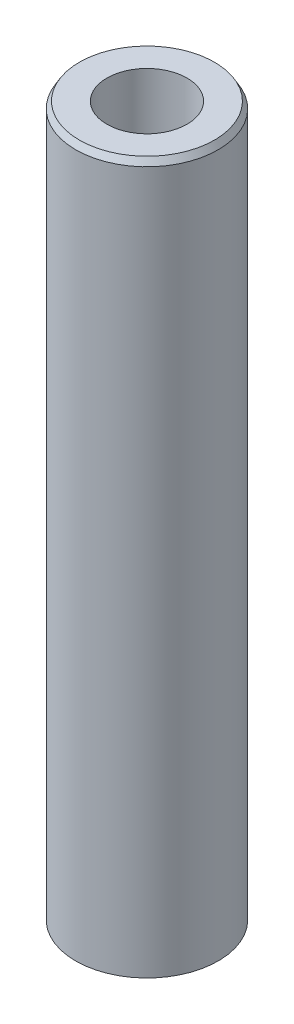
ISO-10303-21;
HEADER;
FILE_DESCRIPTION(('STEP AP214'),'2;1');
FILE_NAME('part.step','',(''),(''),'','','');
FILE_SCHEMA(('AUTOMOTIVE_DESIGN { 1 0 10303 214 1 1 1 1 }'));
ENDSEC;
DATA;
#1=APPLICATION_CONTEXT('core data for automotive mechanical design processes');
#2=APPLICATION_PROTOCOL_DEFINITION('international standard','automotive_design',2000,#1);
#3=PRODUCT_CONTEXT('',#1,'mechanical');
#4=PRODUCT('Part','Part','',(#3));
#5=PRODUCT_RELATED_PRODUCT_CATEGORY('part','',(#4));
#6=PRODUCT_DEFINITION_FORMATION('','',#4);
#7=PRODUCT_DEFINITION_CONTEXT('part definition',#1,'design');
#8=PRODUCT_DEFINITION('design','',#6,#7);
#9=PRODUCT_DEFINITION_SHAPE('','',#8);
#10=(LENGTH_UNIT() NAMED_UNIT(*) SI_UNIT(.MILLI.,.METRE.));
#11=(NAMED_UNIT(*) PLANE_ANGLE_UNIT() SI_UNIT($,.RADIAN.));
#12=(NAMED_UNIT(*) SI_UNIT($,.STERADIAN.) SOLID_ANGLE_UNIT());
#13=UNCERTAINTY_MEASURE_WITH_UNIT(LENGTH_MEASURE(1.E-05),#10,'distance_accuracy_value','');
#14=(GEOMETRIC_REPRESENTATION_CONTEXT(3) GLOBAL_UNCERTAINTY_ASSIGNED_CONTEXT((#13)) GLOBAL_UNIT_ASSIGNED_CONTEXT((#10,
#11,#12)) REPRESENTATION_CONTEXT('',''));
#15=CARTESIAN_POINT('',(0.,0.,0.));
#16=DIRECTION('',(0.,0.,1.));
#17=DIRECTION('',(1.,0.,0.));
#18=AXIS2_PLACEMENT_3D('',#15,#16,#17);
#19=CARTESIAN_POINT('',(0.,600.,0.));
#20=DIRECTION('',(0.,-1.,0.));
#21=DIRECTION('',(0.,0.,-1.));
#22=AXIS2_PLACEMENT_3D('',#19,#20,#21);
#23=CYLINDRICAL_SURFACE('',#22,60.);
#24=CARTESIAN_POINT('',(0.,594.546026563201,0.));
#25=DIRECTION('',(0.,1.,0.));
#26=DIRECTION('',(0.,0.,1.));
#27=AXIS2_PLACEMENT_3D('',#24,#25,#26);
#28=CIRCLE('',#27,60.);
#29=CARTESIAN_POINT('',(0.,594.546026563201,60.));
#30=VERTEX_POINT('',#29);
#31=EDGE_CURVE('E50',#30,#30,#28,.F.);
#32=ORIENTED_EDGE('',*,*,#31,.T.);
#33=EDGE_LOOP('',(#32));
#34=FACE_BOUND('',#33,.T.);
#35=CARTESIAN_POINT('',(0.,3.14885303188894,0.));
#36=DIRECTION('',(0.,1.,0.));
#37=DIRECTION('',(0.,0.,1.));
#38=AXIS2_PLACEMENT_3D('',#35,#36,#37);
#39=CIRCLE('',#38,60.);
#40=CARTESIAN_POINT('',(0.,3.14885303188894,60.));
#41=VERTEX_POINT('',#40);
#42=EDGE_CURVE('E51',#41,#41,#39,.T.);
#43=ORIENTED_EDGE('',*,*,#42,.T.);
#44=EDGE_LOOP('',(#43));
#45=FACE_BOUND('',#44,.T.);
#46=ADVANCED_FACE('F39',(#34,#45),#23,.T.);
#47=CARTESIAN_POINT('',(0.,600.,0.));
#48=DIRECTION('',(0.,1.,0.));
#49=DIRECTION('',(0.,0.,1.));
#50=AXIS2_PLACEMENT_3D('',#47,#48,#49);
#51=PLANE('',#50);
#52=CARTESIAN_POINT('',(0.,600.,0.));
#53=DIRECTION('',(0.,1.,0.));
#54=DIRECTION('',(0.,0.,1.));
#55=AXIS2_PLACEMENT_3D('',#52,#53,#54);
#56=CIRCLE('',#55,56.851146968111);
#57=CARTESIAN_POINT('',(0.,600.,56.851146968111));
#58=VERTEX_POINT('',#57);
#59=EDGE_CURVE('E54',#58,#58,#56,.T.);
#60=ORIENTED_EDGE('',*,*,#59,.T.);
#61=EDGE_LOOP('',(#60));
#62=FACE_BOUND('',#61,.T.);
#63=CARTESIAN_POINT('',(0.,600.,0.));
#64=DIRECTION('',(0.,1.,0.));
#65=DIRECTION('',(0.,0.,1.));
#66=AXIS2_PLACEMENT_3D('',#63,#64,#65);
#67=CIRCLE('',#66,33.7250324250112);
#68=CARTESIAN_POINT('',(0.,600.,33.7250324250112));
#69=VERTEX_POINT('',#68);
#70=EDGE_CURVE('E58',#69,#69,#67,.T.);
#71=ORIENTED_EDGE('',*,*,#70,.F.);
#72=EDGE_LOOP('',(#71));
#73=FACE_BOUND('',#72,.T.);
#74=ADVANCED_FACE('F69',(#62,#73),#51,.T.);
#75=CARTESIAN_POINT('',(0.,0.,0.));
#76=DIRECTION('',(0.,1.,0.));
#77=DIRECTION('',(0.,0.,1.));
#78=AXIS2_PLACEMENT_3D('',#75,#76,#77);
#79=PLANE('',#78);
#80=CARTESIAN_POINT('',(0.,0.,0.));
#81=DIRECTION('',(0.,1.,0.));
#82=DIRECTION('',(0.,0.,1.));
#83=AXIS2_PLACEMENT_3D('',#80,#81,#82);
#84=CIRCLE('',#83,54.546026563201);
#85=CARTESIAN_POINT('',(0.,0.,54.546026563201));
#86=VERTEX_POINT('',#85);
#87=EDGE_CURVE('E10',#86,#86,#84,.F.);
#88=ORIENTED_EDGE('',*,*,#87,.T.);
#89=EDGE_LOOP('',(#88));
#90=FACE_BOUND('',#89,.T.);
#91=CARTESIAN_POINT('',(0.,0.,0.));
#92=DIRECTION('',(0.,1.,0.));
#93=DIRECTION('',(0.,0.,1.));
#94=AXIS2_PLACEMENT_3D('',#91,#92,#93);
#95=CIRCLE('',#94,33.7250324250112);
#96=CARTESIAN_POINT('',(0.,0.,33.7250324250112));
#97=VERTEX_POINT('',#96);
#98=EDGE_CURVE('E63',#97,#97,#95,.T.);
#99=ORIENTED_EDGE('',*,*,#98,.T.);
#100=EDGE_LOOP('',(#99));
#101=FACE_BOUND('',#100,.T.);
#102=ADVANCED_FACE('F75',(#90,#101),#79,.F.);
#103=CARTESIAN_POINT('',(0.,600.,0.));
#104=DIRECTION('',(0.,-1.,0.));
#105=DIRECTION('',(0.,0.,-1.));
#106=AXIS2_PLACEMENT_3D('',#103,#104,#105);
#107=CYLINDRICAL_SURFACE('',#106,33.7250324250112);
#108=ORIENTED_EDGE('',*,*,#70,.T.);
#109=EDGE_LOOP('',(#108));
#110=FACE_BOUND('',#109,.T.);
#111=ORIENTED_EDGE('',*,*,#98,.F.);
#112=EDGE_LOOP('',(#111));
#113=FACE_BOUND('',#112,.T.);
#114=ADVANCED_FACE('F70',(#110,#113),#107,.F.);
#115=CARTESIAN_POINT('',(0.,600.,0.));
#116=DIRECTION('',(0.,-1.,0.));
#117=DIRECTION('',(0.,0.,-1.));
#118=AXIS2_PLACEMENT_3D('',#115,#116,#117);
#119=CONICAL_SURFACE('',#118,56.851146968111,0.523598775598295);
#120=ORIENTED_EDGE('',*,*,#31,.F.);
#121=EDGE_LOOP('',(#120));
#122=FACE_BOUND('',#121,.T.);
#123=ORIENTED_EDGE('',*,*,#59,.F.);
#124=EDGE_LOOP('',(#123));
#125=FACE_BOUND('',#124,.T.);
#126=ADVANCED_FACE('F81',(#122,#125),#119,.T.);
#127=CARTESIAN_POINT('',(0.,3.14885303188894,0.));
#128=DIRECTION('',(0.,1.,0.));
#129=DIRECTION('',(0.,0.,1.));
#130=AXIS2_PLACEMENT_3D('',#127,#128,#129);
#131=CONICAL_SURFACE('',#130,60.,1.0471975511966);
#132=ORIENTED_EDGE('',*,*,#87,.F.);
#133=EDGE_LOOP('',(#132));
#134=FACE_BOUND('',#133,.T.);
#135=ORIENTED_EDGE('',*,*,#42,.F.);
#136=EDGE_LOOP('',(#135));
#137=FACE_BOUND('',#136,.T.);
#138=ADVANCED_FACE('F45',(#134,#137),#131,.T.);
#139=CLOSED_SHELL('',(#46,#74,#102,#114,#126,#138));
#140=MANIFOLD_SOLID_BREP('B2',#139);
#141=ADVANCED_BREP_SHAPE_REPRESENTATION('',(#18,#140),#14);
#142=SHAPE_DEFINITION_REPRESENTATION(#9,#141);
ENDSEC;
END-ISO-10303-21;
